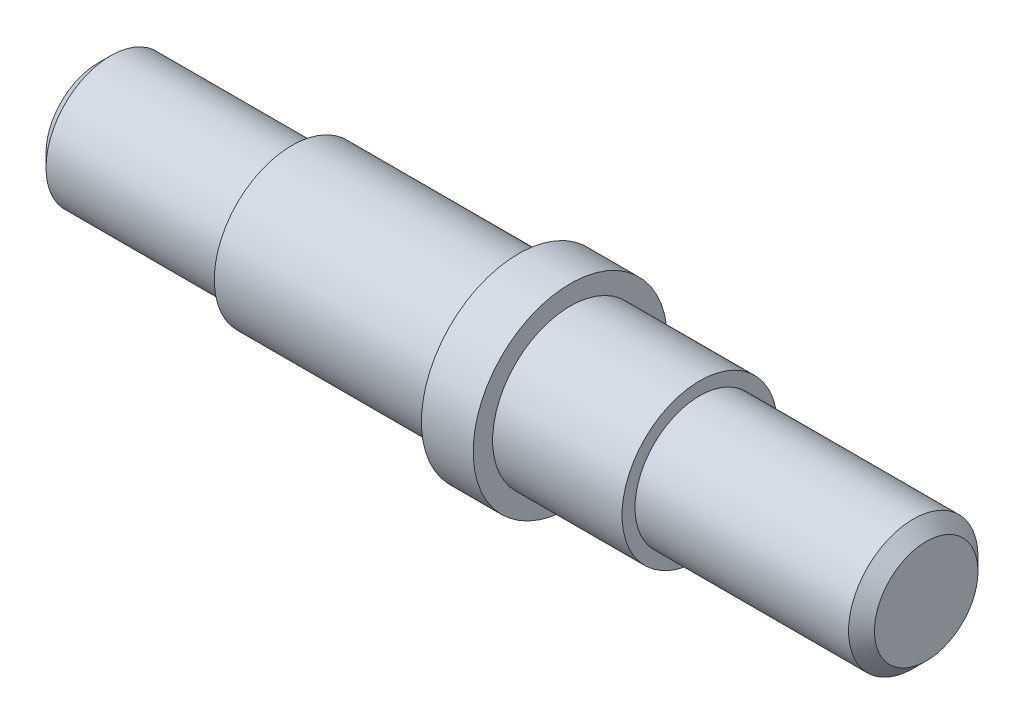
ISO-10303-21;
HEADER;
FILE_DESCRIPTION(('STEP AP214'),'2;1');
FILE_NAME('part.step','',(''),(''),'','','');
FILE_SCHEMA(('AUTOMOTIVE_DESIGN { 1 0 10303 214 1 1 1 1 }'));
ENDSEC;
DATA;
#1=APPLICATION_CONTEXT('core data for automotive mechanical design processes');
#2=APPLICATION_PROTOCOL_DEFINITION('international standard','automotive_design',2000,#1);
#3=PRODUCT_CONTEXT('',#1,'mechanical');
#4=PRODUCT('Part','Part','',(#3));
#5=PRODUCT_RELATED_PRODUCT_CATEGORY('part','',(#4));
#6=PRODUCT_DEFINITION_FORMATION('','',#4);
#7=PRODUCT_DEFINITION_CONTEXT('part definition',#1,'design');
#8=PRODUCT_DEFINITION('design','',#6,#7);
#9=PRODUCT_DEFINITION_SHAPE('','',#8);
#10=(LENGTH_UNIT() NAMED_UNIT(*) SI_UNIT(.MILLI.,.METRE.));
#11=(NAMED_UNIT(*) PLANE_ANGLE_UNIT() SI_UNIT($,.RADIAN.));
#12=(NAMED_UNIT(*) SI_UNIT($,.STERADIAN.) SOLID_ANGLE_UNIT());
#13=UNCERTAINTY_MEASURE_WITH_UNIT(LENGTH_MEASURE(1.E-05),#10,'distance_accuracy_value','');
#14=(GEOMETRIC_REPRESENTATION_CONTEXT(3) GLOBAL_UNCERTAINTY_ASSIGNED_CONTEXT((#13)) GLOBAL_UNIT_ASSIGNED_CONTEXT((#10,
#11,#12)) REPRESENTATION_CONTEXT('',''));
#15=CARTESIAN_POINT('',(0.,0.,0.));
#16=DIRECTION('',(0.,0.,1.));
#17=DIRECTION('',(1.,0.,0.));
#18=AXIS2_PLACEMENT_3D('',#15,#16,#17);
#19=CARTESIAN_POINT('',(0.,0.,0.));
#20=DIRECTION('',(-1.,0.,0.));
#21=DIRECTION('',(0.,0.,1.));
#22=AXIS2_PLACEMENT_3D('',#19,#20,#21);
#23=PLANE('',#22);
#24=CARTESIAN_POINT('',(0.,0.,0.));
#25=DIRECTION('',(-1.,0.,0.));
#26=DIRECTION('',(0.,0.,1.));
#27=AXIS2_PLACEMENT_3D('',#24,#25,#26);
#28=CIRCLE('',#27,7.99999999999999);
#29=CARTESIAN_POINT('',(0.,0.,7.99999999999999));
#30=VERTEX_POINT('',#29);
#31=EDGE_CURVE('E44',#30,#30,#28,.T.);
#32=ORIENTED_EDGE('',*,*,#31,.T.);
#33=EDGE_LOOP('',(#32));
#34=FACE_BOUND('',#33,.T.);
#35=ADVANCED_FACE('F33',(#34),#23,.T.);
#36=CARTESIAN_POINT('',(128.,0.,0.));
#37=DIRECTION('',(1.,0.,0.));
#38=DIRECTION('',(0.,0.,-1.));
#39=AXIS2_PLACEMENT_3D('',#36,#37,#38);
#40=CYLINDRICAL_SURFACE('',#39,9.99999999999999);
#41=CARTESIAN_POINT('',(1.99999999999997,0.,0.));
#42=DIRECTION('',(-1.,0.,0.));
#43=DIRECTION('',(0.,0.,1.));
#44=AXIS2_PLACEMENT_3D('',#41,#42,#43);
#45=CIRCLE('',#44,9.99999999999999);
#46=CARTESIAN_POINT('',(1.99999999999997,0.,9.99999999999999));
#47=VERTEX_POINT('',#46);
#48=EDGE_CURVE('E48',#47,#47,#45,.F.);
#49=ORIENTED_EDGE('',*,*,#48,.T.);
#50=EDGE_LOOP('',(#49));
#51=FACE_BOUND('',#50,.T.);
#52=CARTESIAN_POINT('',(30.,0.,0.));
#53=DIRECTION('',(1.,0.,0.));
#54=DIRECTION('',(0.,0.,-1.));
#55=AXIS2_PLACEMENT_3D('',#52,#53,#54);
#56=CIRCLE('',#55,9.99999999999999);
#57=CARTESIAN_POINT('',(30.,0.,-9.99999999999999));
#58=VERTEX_POINT('',#57);
#59=EDGE_CURVE('E53',#58,#58,#56,.T.);
#60=ORIENTED_EDGE('',*,*,#59,.F.);
#61=EDGE_LOOP('',(#60));
#62=FACE_BOUND('',#61,.T.);
#63=ADVANCED_FACE('F95',(#51,#62),#40,.T.);
#64=CARTESIAN_POINT('',(30.,9.99999999999999,0.));
#65=DIRECTION('',(-1.,0.,0.));
#66=DIRECTION('',(0.,0.,1.));
#67=AXIS2_PLACEMENT_3D('',#64,#65,#66);
#68=PLANE('',#67);
#69=ORIENTED_EDGE('',*,*,#59,.T.);
#70=EDGE_LOOP('',(#69));
#71=FACE_BOUND('',#70,.T.);
#72=CARTESIAN_POINT('',(30.,0.,0.));
#73=DIRECTION('',(1.,0.,0.));
#74=DIRECTION('',(0.,0.,-1.));
#75=AXIS2_PLACEMENT_3D('',#72,#73,#74);
#76=CIRCLE('',#75,12.);
#77=CARTESIAN_POINT('',(30.,0.,-12.));
#78=VERTEX_POINT('',#77);
#79=EDGE_CURVE('E56',#78,#78,#76,.T.);
#80=ORIENTED_EDGE('',*,*,#79,.F.);
#81=EDGE_LOOP('',(#80));
#82=FACE_BOUND('',#81,.T.);
#83=ADVANCED_FACE('F101',(#71,#82),#68,.T.);
#84=CARTESIAN_POINT('',(128.,0.,0.));
#85=DIRECTION('',(1.,0.,0.));
#86=DIRECTION('',(0.,0.,-1.));
#87=AXIS2_PLACEMENT_3D('',#84,#85,#86);
#88=CYLINDRICAL_SURFACE('',#87,12.);
#89=ORIENTED_EDGE('',*,*,#79,.T.);
#90=EDGE_LOOP('',(#89));
#91=FACE_BOUND('',#90,.T.);
#92=CARTESIAN_POINT('',(65.,0.,0.));
#93=DIRECTION('',(1.,0.,0.));
#94=DIRECTION('',(0.,0.,-1.));
#95=AXIS2_PLACEMENT_3D('',#92,#93,#94);
#96=CIRCLE('',#95,12.);
#97=CARTESIAN_POINT('',(65.,0.,-12.));
#98=VERTEX_POINT('',#97);
#99=EDGE_CURVE('E59',#98,#98,#96,.T.);
#100=ORIENTED_EDGE('',*,*,#99,.F.);
#101=EDGE_LOOP('',(#100));
#102=FACE_BOUND('',#101,.T.);
#103=ADVANCED_FACE('F122',(#91,#102),#88,.T.);
#104=CARTESIAN_POINT('',(65.,12.,0.));
#105=DIRECTION('',(-1.,0.,0.));
#106=DIRECTION('',(0.,0.,1.));
#107=AXIS2_PLACEMENT_3D('',#104,#105,#106);
#108=PLANE('',#107);
#109=ORIENTED_EDGE('',*,*,#99,.T.);
#110=EDGE_LOOP('',(#109));
#111=FACE_BOUND('',#110,.T.);
#112=CARTESIAN_POINT('',(65.,0.,0.));
#113=DIRECTION('',(1.,0.,0.));
#114=DIRECTION('',(0.,0.,-1.));
#115=AXIS2_PLACEMENT_3D('',#112,#113,#114);
#116=CIRCLE('',#115,15.);
#117=CARTESIAN_POINT('',(65.,0.,-15.));
#118=VERTEX_POINT('',#117);
#119=EDGE_CURVE('E62',#118,#118,#116,.T.);
#120=ORIENTED_EDGE('',*,*,#119,.F.);
#121=EDGE_LOOP('',(#120));
#122=FACE_BOUND('',#121,.T.);
#123=ADVANCED_FACE('F127',(#111,#122),#108,.T.);
#124=CARTESIAN_POINT('',(128.,0.,0.));
#125=DIRECTION('',(1.,0.,0.));
#126=DIRECTION('',(0.,0.,-1.));
#127=AXIS2_PLACEMENT_3D('',#124,#125,#126);
#128=CYLINDRICAL_SURFACE('',#127,15.);
#129=ORIENTED_EDGE('',*,*,#119,.T.);
#130=EDGE_LOOP('',(#129));
#131=FACE_BOUND('',#130,.T.);
#132=CARTESIAN_POINT('',(73.,0.,0.));
#133=DIRECTION('',(1.,0.,0.));
#134=DIRECTION('',(0.,0.,-1.));
#135=AXIS2_PLACEMENT_3D('',#132,#133,#134);
#136=CIRCLE('',#135,15.);
#137=CARTESIAN_POINT('',(73.,0.,-15.));
#138=VERTEX_POINT('',#137);
#139=EDGE_CURVE('E65',#138,#138,#136,.T.);
#140=ORIENTED_EDGE('',*,*,#139,.F.);
#141=EDGE_LOOP('',(#140));
#142=FACE_BOUND('',#141,.T.);
#143=ADVANCED_FACE('F133',(#131,#142),#128,.T.);
#144=CARTESIAN_POINT('',(73.,15.,0.));
#145=DIRECTION('',(1.,0.,0.));
#146=DIRECTION('',(0.,0.,-1.));
#147=AXIS2_PLACEMENT_3D('',#144,#145,#146);
#148=PLANE('',#147);
#149=ORIENTED_EDGE('',*,*,#139,.T.);
#150=EDGE_LOOP('',(#149));
#151=FACE_BOUND('',#150,.T.);
#152=CARTESIAN_POINT('',(73.,0.,0.));
#153=DIRECTION('',(1.,0.,0.));
#154=DIRECTION('',(0.,0.,-1.));
#155=AXIS2_PLACEMENT_3D('',#152,#153,#154);
#156=CIRCLE('',#155,12.);
#157=CARTESIAN_POINT('',(73.,0.,-12.));
#158=VERTEX_POINT('',#157);
#159=EDGE_CURVE('E68',#158,#158,#156,.T.);
#160=ORIENTED_EDGE('',*,*,#159,.F.);
#161=EDGE_LOOP('',(#160));
#162=FACE_BOUND('',#161,.T.);
#163=ADVANCED_FACE('F91',(#151,#162),#148,.T.);
#164=CARTESIAN_POINT('',(128.,0.,0.));
#165=DIRECTION('',(1.,0.,0.));
#166=DIRECTION('',(0.,0.,-1.));
#167=AXIS2_PLACEMENT_3D('',#164,#165,#166);
#168=CYLINDRICAL_SURFACE('',#167,12.);
#169=ORIENTED_EDGE('',*,*,#159,.T.);
#170=EDGE_LOOP('',(#169));
#171=FACE_BOUND('',#170,.T.);
#172=CARTESIAN_POINT('',(93.,0.,0.));
#173=DIRECTION('',(1.,0.,0.));
#174=DIRECTION('',(0.,0.,-1.));
#175=AXIS2_PLACEMENT_3D('',#172,#173,#174);
#176=CIRCLE('',#175,12.);
#177=CARTESIAN_POINT('',(93.,0.,-12.));
#178=VERTEX_POINT('',#177);
#179=EDGE_CURVE('E71',#178,#178,#176,.T.);
#180=ORIENTED_EDGE('',*,*,#179,.F.);
#181=EDGE_LOOP('',(#180));
#182=FACE_BOUND('',#181,.T.);
#183=ADVANCED_FACE('F82',(#171,#182),#168,.T.);
#184=CARTESIAN_POINT('',(93.,12.,0.));
#185=DIRECTION('',(1.,0.,0.));
#186=DIRECTION('',(0.,0.,-1.));
#187=AXIS2_PLACEMENT_3D('',#184,#185,#186);
#188=PLANE('',#187);
#189=ORIENTED_EDGE('',*,*,#179,.T.);
#190=EDGE_LOOP('',(#189));
#191=FACE_BOUND('',#190,.T.);
#192=CARTESIAN_POINT('',(93.,0.,0.));
#193=DIRECTION('',(1.,0.,0.));
#194=DIRECTION('',(0.,0.,-1.));
#195=AXIS2_PLACEMENT_3D('',#192,#193,#194);
#196=CIRCLE('',#195,9.99999999999998);
#197=CARTESIAN_POINT('',(93.,0.,-9.99999999999998));
#198=VERTEX_POINT('',#197);
#199=EDGE_CURVE('E74',#198,#198,#196,.T.);
#200=ORIENTED_EDGE('',*,*,#199,.F.);
#201=EDGE_LOOP('',(#200));
#202=FACE_BOUND('',#201,.T.);
#203=ADVANCED_FACE('F80',(#191,#202),#188,.T.);
#204=CARTESIAN_POINT('',(128.,0.,0.));
#205=DIRECTION('',(1.,0.,0.));
#206=DIRECTION('',(0.,0.,-1.));
#207=AXIS2_PLACEMENT_3D('',#204,#205,#206);
#208=CYLINDRICAL_SURFACE('',#207,9.99999999999998);
#209=CARTESIAN_POINT('',(126.,0.,0.));
#210=DIRECTION('',(1.,0.,0.));
#211=DIRECTION('',(0.,0.,-1.));
#212=AXIS2_PLACEMENT_3D('',#209,#210,#211);
#213=CIRCLE('',#212,9.99999999999998);
#214=CARTESIAN_POINT('',(126.,0.,-9.99999999999998));
#215=VERTEX_POINT('',#214);
#216=EDGE_CURVE('E10',#215,#215,#213,.F.);
#217=ORIENTED_EDGE('',*,*,#216,.T.);
#218=EDGE_LOOP('',(#217));
#219=FACE_BOUND('',#218,.T.);
#220=ORIENTED_EDGE('',*,*,#199,.T.);
#221=EDGE_LOOP('',(#220));
#222=FACE_BOUND('',#221,.T.);
#223=ADVANCED_FACE('F78',(#219,#222),#208,.T.);
#224=CARTESIAN_POINT('',(128.,9.99999999999998,0.));
#225=DIRECTION('',(1.,0.,0.));
#226=DIRECTION('',(0.,0.,-1.));
#227=AXIS2_PLACEMENT_3D('',#224,#225,#226);
#228=PLANE('',#227);
#229=CARTESIAN_POINT('',(128.,0.,0.));
#230=DIRECTION('',(1.,0.,0.));
#231=DIRECTION('',(0.,0.,-1.));
#232=AXIS2_PLACEMENT_3D('',#229,#230,#231);
#233=CIRCLE('',#232,8.00000000000001);
#234=CARTESIAN_POINT('',(128.,0.,-8.00000000000001));
#235=VERTEX_POINT('',#234);
#236=EDGE_CURVE('E40',#235,#235,#233,.T.);
#237=ORIENTED_EDGE('',*,*,#236,.T.);
#238=EDGE_LOOP('',(#237));
#239=FACE_BOUND('',#238,.T.);
#240=ADVANCED_FACE('F89',(#239),#228,.T.);
#241=CARTESIAN_POINT('',(1.99999999999997,0.,0.));
#242=DIRECTION('',(1.,0.,0.));
#243=DIRECTION('',(0.,0.,-1.));
#244=AXIS2_PLACEMENT_3D('',#241,#242,#243);
#245=CONICAL_SURFACE('',#244,9.99999999999999,0.785398163397453);
#246=ORIENTED_EDGE('',*,*,#31,.F.);
#247=EDGE_LOOP('',(#246));
#248=FACE_BOUND('',#247,.T.);
#249=ORIENTED_EDGE('',*,*,#48,.F.);
#250=EDGE_LOOP('',(#249));
#251=FACE_BOUND('',#250,.T.);
#252=ADVANCED_FACE('F105',(#248,#251),#245,.T.);
#253=CARTESIAN_POINT('',(128.,0.,0.));
#254=DIRECTION('',(-1.,0.,0.));
#255=DIRECTION('',(0.,0.,1.));
#256=AXIS2_PLACEMENT_3D('',#253,#254,#255);
#257=CONICAL_SURFACE('',#256,8.00000000000001,0.785398163397449);
#258=ORIENTED_EDGE('',*,*,#216,.F.);
#259=EDGE_LOOP('',(#258));
#260=FACE_BOUND('',#259,.T.);
#261=ORIENTED_EDGE('',*,*,#236,.F.);
#262=EDGE_LOOP('',(#261));
#263=FACE_BOUND('',#262,.T.);
#264=ADVANCED_FACE('F35',(#260,#263),#257,.T.);
#265=CLOSED_SHELL('',(#35,#63,#83,#103,#123,#143,#163,#183,#203,#223,#240,#252,#264));
#266=MANIFOLD_SOLID_BREP('B2',#265);
#267=ADVANCED_BREP_SHAPE_REPRESENTATION('',(#18,#266),#14);
#268=SHAPE_DEFINITION_REPRESENTATION(#9,#267);
ENDSEC;
END-ISO-10303-21;
